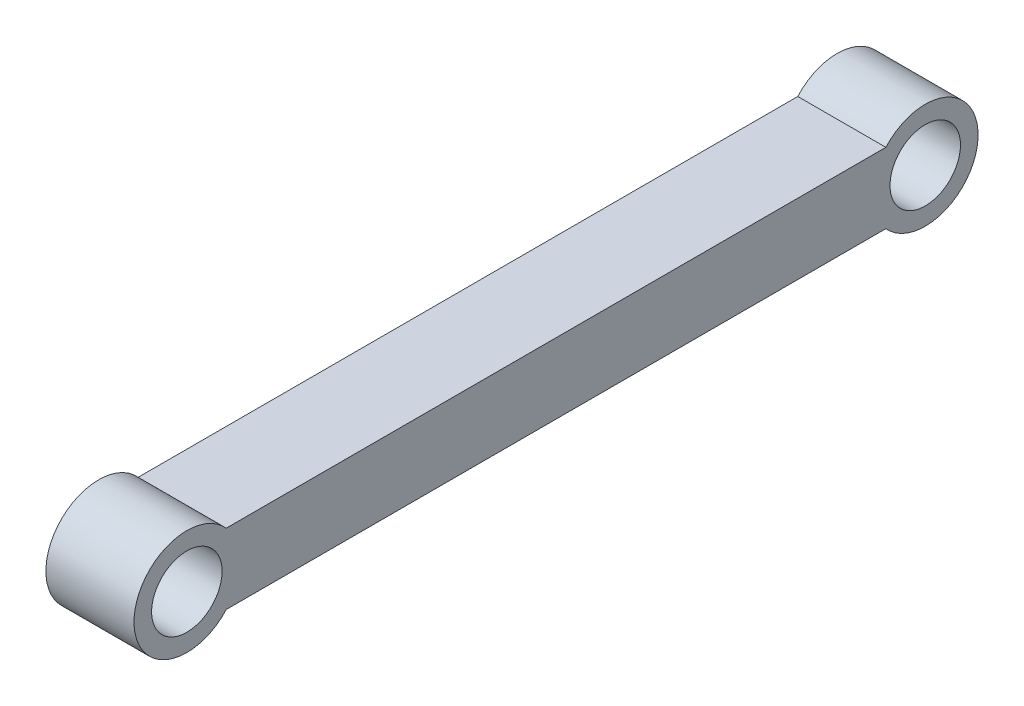
ISO-10303-21;
HEADER;
FILE_DESCRIPTION(('STEP AP214'),'2;1');
FILE_NAME('part.step','',(''),(''),'','','');
FILE_SCHEMA(('AUTOMOTIVE_DESIGN { 1 0 10303 214 1 1 1 1 }'));
ENDSEC;
DATA;
#1=APPLICATION_CONTEXT('core data for automotive mechanical design processes');
#2=APPLICATION_PROTOCOL_DEFINITION('international standard','automotive_design',2000,#1);
#3=PRODUCT_CONTEXT('',#1,'mechanical');
#4=PRODUCT('Part','Part','',(#3));
#5=PRODUCT_RELATED_PRODUCT_CATEGORY('part','',(#4));
#6=PRODUCT_DEFINITION_FORMATION('','',#4);
#7=PRODUCT_DEFINITION_CONTEXT('part definition',#1,'design');
#8=PRODUCT_DEFINITION('design','',#6,#7);
#9=PRODUCT_DEFINITION_SHAPE('','',#8);
#10=(LENGTH_UNIT() NAMED_UNIT(*) SI_UNIT(.MILLI.,.METRE.));
#11=(NAMED_UNIT(*) PLANE_ANGLE_UNIT() SI_UNIT($,.RADIAN.));
#12=(NAMED_UNIT(*) SI_UNIT($,.STERADIAN.) SOLID_ANGLE_UNIT());
#13=UNCERTAINTY_MEASURE_WITH_UNIT(LENGTH_MEASURE(1.E-05),#10,'distance_accuracy_value','');
#14=(GEOMETRIC_REPRESENTATION_CONTEXT(3) GLOBAL_UNCERTAINTY_ASSIGNED_CONTEXT((#13)) GLOBAL_UNIT_ASSIGNED_CONTEXT((#10,
#11,#12)) REPRESENTATION_CONTEXT('',''));
#15=CARTESIAN_POINT('',(0.,0.,0.));
#16=DIRECTION('',(0.,0.,1.));
#17=DIRECTION('',(1.,0.,0.));
#18=AXIS2_PLACEMENT_3D('',#15,#16,#17);
#19=CARTESIAN_POINT('',(100.,-226.263273144616,578.53553858004));
#20=DIRECTION('',(1.,0.,0.));
#21=DIRECTION('',(0.,0.,-1.));
#22=AXIS2_PLACEMENT_3D('',#19,#20,#21);
#23=PLANE('',#22);
#24=CARTESIAN_POINT('',(100.,-226.263273144619,-259.65446141996));
#25=DIRECTION('',(1.,0.,0.));
#26=DIRECTION('',(0.,0.,-1.));
#27=AXIS2_PLACEMENT_3D('',#24,#25,#26);
#28=CIRCLE('',#27,40.0000000000001);
#29=CARTESIAN_POINT('',(100.,-226.263273144619,-299.65446141996));
#30=VERTEX_POINT('',#29);
#31=EDGE_CURVE('E106',#30,#30,#28,.T.);
#32=ORIENTED_EDGE('',*,*,#31,.F.);
#33=EDGE_LOOP('',(#32));
#34=FACE_BOUND('',#33,.T.);
#35=CARTESIAN_POINT('',(100.,-226.263273144616,578.53553858004));
#36=DIRECTION('',(1.,0.,0.));
#37=DIRECTION('',(0.,0.,-1.));
#38=AXIS2_PLACEMENT_3D('',#35,#36,#37);
#39=CIRCLE('',#38,60.);
#40=CARTESIAN_POINT('',(100.,-186.263273144616,533.814179030044));
#41=VERTEX_POINT('',#40);
#42=CARTESIAN_POINT('',(100.,-266.263273144616,533.814179030044));
#43=VERTEX_POINT('',#42);
#44=EDGE_CURVE('E91',#41,#43,#39,.T.);
#45=ORIENTED_EDGE('',*,*,#44,.T.);
#46=DIRECTION('',(0.,0.,-1.));
#47=VECTOR('',#46,1.);
#48=CARTESIAN_POINT('',(100.,-266.263273144616,533.814179030044));
#49=LINE('',#48,#47);
#50=CARTESIAN_POINT('',(100.,-266.263273144618,-214.933101869964));
#51=VERTEX_POINT('',#50);
#52=EDGE_CURVE('E86',#43,#51,#49,.T.);
#53=ORIENTED_EDGE('',*,*,#52,.T.);
#54=CARTESIAN_POINT('',(100.,-226.263273144619,-259.65446141996));
#55=DIRECTION('',(1.,0.,0.));
#56=DIRECTION('',(0.,0.,-1.));
#57=AXIS2_PLACEMENT_3D('',#54,#55,#56);
#58=CIRCLE('',#57,60.);
#59=CARTESIAN_POINT('',(100.,-186.263273144618,-214.933101869965));
#60=VERTEX_POINT('',#59);
#61=EDGE_CURVE('E89',#51,#60,#58,.T.);
#62=ORIENTED_EDGE('',*,*,#61,.T.);
#63=DIRECTION('',(0.,0.,1.));
#64=VECTOR('',#63,1.);
#65=CARTESIAN_POINT('',(100.,-186.263273144616,533.814179030044));
#66=LINE('',#65,#64);
#67=EDGE_CURVE('E56',#60,#41,#66,.T.);
#68=ORIENTED_EDGE('',*,*,#67,.T.);
#69=EDGE_LOOP('',(#45,#53,#62,#68));
#70=FACE_BOUND('',#69,.T.);
#71=CARTESIAN_POINT('',(100.,-226.263273144616,578.53553858004));
#72=DIRECTION('',(1.,0.,0.));
#73=DIRECTION('',(0.,0.,-1.));
#74=AXIS2_PLACEMENT_3D('',#71,#72,#73);
#75=CIRCLE('',#74,39.9999999999999);
#76=CARTESIAN_POINT('',(100.,-226.263273144616,538.53553858004));
#77=VERTEX_POINT('',#76);
#78=EDGE_CURVE('E121',#77,#77,#75,.T.);
#79=ORIENTED_EDGE('',*,*,#78,.F.);
#80=EDGE_LOOP('',(#79));
#81=FACE_BOUND('',#80,.T.);
#82=ADVANCED_FACE('F39',(#34,#70,#81),#23,.T.);
#83=CARTESIAN_POINT('',(0.,-226.263273144616,578.53553858004));
#84=DIRECTION('',(1.,0.,0.));
#85=DIRECTION('',(0.,0.,-1.));
#86=AXIS2_PLACEMENT_3D('',#83,#84,#85);
#87=PLANE('',#86);
#88=CARTESIAN_POINT('',(0.,-226.263273144616,578.53553858004));
#89=DIRECTION('',(1.,0.,0.));
#90=DIRECTION('',(0.,0.,-1.));
#91=AXIS2_PLACEMENT_3D('',#88,#89,#90);
#92=CIRCLE('',#91,60.);
#93=CARTESIAN_POINT('',(0.,-186.263273144616,533.814179030044));
#94=VERTEX_POINT('',#93);
#95=CARTESIAN_POINT('',(0.,-266.263273144616,533.814179030044));
#96=VERTEX_POINT('',#95);
#97=EDGE_CURVE('E103',#94,#96,#92,.T.);
#98=ORIENTED_EDGE('',*,*,#97,.F.);
#99=DIRECTION('',(0.,0.,1.));
#100=VECTOR('',#99,1.);
#101=CARTESIAN_POINT('',(0.,-186.263273144616,533.814179030044));
#102=LINE('',#101,#100);
#103=CARTESIAN_POINT('',(0.,-186.263273144618,-214.933101869965));
#104=VERTEX_POINT('',#103);
#105=EDGE_CURVE('E79',#104,#94,#102,.T.);
#106=ORIENTED_EDGE('',*,*,#105,.F.);
#107=CARTESIAN_POINT('',(0.,-226.263273144619,-259.65446141996));
#108=DIRECTION('',(1.,0.,0.));
#109=DIRECTION('',(0.,0.,-1.));
#110=AXIS2_PLACEMENT_3D('',#107,#108,#109);
#111=CIRCLE('',#110,60.);
#112=CARTESIAN_POINT('',(0.,-266.263273144618,-214.933101869964));
#113=VERTEX_POINT('',#112);
#114=EDGE_CURVE('E73',#113,#104,#111,.T.);
#115=ORIENTED_EDGE('',*,*,#114,.F.);
#116=DIRECTION('',(0.,0.,-1.));
#117=VECTOR('',#116,1.);
#118=CARTESIAN_POINT('',(0.,-266.263273144616,533.814179030044));
#119=LINE('',#118,#117);
#120=EDGE_CURVE('E95',#96,#113,#119,.T.);
#121=ORIENTED_EDGE('',*,*,#120,.F.);
#122=EDGE_LOOP('',(#98,#106,#115,#121));
#123=FACE_BOUND('',#122,.T.);
#124=CARTESIAN_POINT('',(0.,-226.263273144619,-259.65446141996));
#125=DIRECTION('',(1.,0.,0.));
#126=DIRECTION('',(0.,0.,-1.));
#127=AXIS2_PLACEMENT_3D('',#124,#125,#126);
#128=CIRCLE('',#127,40.0000000000001);
#129=CARTESIAN_POINT('',(0.,-226.263273144619,-299.65446141996));
#130=VERTEX_POINT('',#129);
#131=EDGE_CURVE('E118',#130,#130,#128,.T.);
#132=ORIENTED_EDGE('',*,*,#131,.T.);
#133=EDGE_LOOP('',(#132));
#134=FACE_BOUND('',#133,.T.);
#135=CARTESIAN_POINT('',(0.,-226.263273144616,578.53553858004));
#136=DIRECTION('',(1.,0.,0.));
#137=DIRECTION('',(0.,0.,-1.));
#138=AXIS2_PLACEMENT_3D('',#135,#136,#137);
#139=CIRCLE('',#138,39.9999999999999);
#140=CARTESIAN_POINT('',(0.,-226.263273144616,538.53553858004));
#141=VERTEX_POINT('',#140);
#142=EDGE_CURVE('E124',#141,#141,#139,.T.);
#143=ORIENTED_EDGE('',*,*,#142,.T.);
#144=EDGE_LOOP('',(#143));
#145=FACE_BOUND('',#144,.T.);
#146=ADVANCED_FACE('F114',(#123,#134,#145),#87,.F.);
#147=CARTESIAN_POINT('',(100.,-226.263273144616,578.53553858004));
#148=DIRECTION('',(-1.,0.,0.));
#149=DIRECTION('',(0.,0.,1.));
#150=AXIS2_PLACEMENT_3D('',#147,#148,#149);
#151=CYLINDRICAL_SURFACE('',#150,60.);
#152=ORIENTED_EDGE('',*,*,#97,.T.);
#153=DIRECTION('',(-1.,0.,0.));
#154=VECTOR('',#153,1.);
#155=CARTESIAN_POINT('',(100.,-266.263273144616,533.814179030044));
#156=LINE('',#155,#154);
#157=EDGE_CURVE('E11',#43,#96,#156,.T.);
#158=ORIENTED_EDGE('',*,*,#157,.F.);
#159=ORIENTED_EDGE('',*,*,#44,.F.);
#160=DIRECTION('',(-1.,0.,0.));
#161=VECTOR('',#160,1.);
#162=CARTESIAN_POINT('',(100.,-186.263273144616,533.814179030044));
#163=LINE('',#162,#161);
#164=EDGE_CURVE('E99',#41,#94,#163,.T.);
#165=ORIENTED_EDGE('',*,*,#164,.T.);
#166=EDGE_LOOP('',(#152,#158,#159,#165));
#167=FACE_BOUND('',#166,.T.);
#168=ADVANCED_FACE('F41',(#167),#151,.T.);
#169=CARTESIAN_POINT('',(100.,-266.263273144616,533.814179030044));
#170=DIRECTION('',(0.,1.,0.));
#171=DIRECTION('',(0.,0.,1.));
#172=AXIS2_PLACEMENT_3D('',#169,#170,#171);
#173=PLANE('',#172);
#174=ORIENTED_EDGE('',*,*,#120,.T.);
#175=DIRECTION('',(-1.,0.,0.));
#176=VECTOR('',#175,1.);
#177=CARTESIAN_POINT('',(100.,-266.263273144618,-214.933101869964));
#178=LINE('',#177,#176);
#179=EDGE_CURVE('E48',#51,#113,#178,.T.);
#180=ORIENTED_EDGE('',*,*,#179,.F.);
#181=ORIENTED_EDGE('',*,*,#52,.F.);
#182=ORIENTED_EDGE('',*,*,#157,.T.);
#183=EDGE_LOOP('',(#174,#180,#181,#182));
#184=FACE_BOUND('',#183,.T.);
#185=ADVANCED_FACE('F94',(#184),#173,.F.);
#186=CARTESIAN_POINT('',(100.,-226.263273144619,-259.65446141996));
#187=DIRECTION('',(-1.,0.,0.));
#188=DIRECTION('',(0.,0.,1.));
#189=AXIS2_PLACEMENT_3D('',#186,#187,#188);
#190=CYLINDRICAL_SURFACE('',#189,60.);
#191=ORIENTED_EDGE('',*,*,#114,.T.);
#192=DIRECTION('',(-1.,0.,0.));
#193=VECTOR('',#192,1.);
#194=CARTESIAN_POINT('',(100.,-186.263273144618,-214.933101869965));
#195=LINE('',#194,#193);
#196=EDGE_CURVE('E96',#60,#104,#195,.T.);
#197=ORIENTED_EDGE('',*,*,#196,.F.);
#198=ORIENTED_EDGE('',*,*,#61,.F.);
#199=ORIENTED_EDGE('',*,*,#179,.T.);
#200=EDGE_LOOP('',(#191,#197,#198,#199));
#201=FACE_BOUND('',#200,.T.);
#202=ADVANCED_FACE('F97',(#201),#190,.T.);
#203=CARTESIAN_POINT('',(100.,-186.263273144616,533.814179030044));
#204=DIRECTION('',(0.,-1.,0.));
#205=DIRECTION('',(0.,0.,-1.));
#206=AXIS2_PLACEMENT_3D('',#203,#204,#205);
#207=PLANE('',#206);
#208=ORIENTED_EDGE('',*,*,#105,.T.);
#209=ORIENTED_EDGE('',*,*,#164,.F.);
#210=ORIENTED_EDGE('',*,*,#67,.F.);
#211=ORIENTED_EDGE('',*,*,#196,.T.);
#212=EDGE_LOOP('',(#208,#209,#210,#211));
#213=FACE_BOUND('',#212,.T.);
#214=ADVANCED_FACE('F111',(#213),#207,.F.);
#215=CARTESIAN_POINT('',(100.,-226.263273144619,-259.65446141996));
#216=DIRECTION('',(-1.,0.,0.));
#217=DIRECTION('',(0.,0.,1.));
#218=AXIS2_PLACEMENT_3D('',#215,#216,#217);
#219=CYLINDRICAL_SURFACE('',#218,40.0000000000001);
#220=ORIENTED_EDGE('',*,*,#31,.T.);
#221=EDGE_LOOP('',(#220));
#222=FACE_BOUND('',#221,.T.);
#223=ORIENTED_EDGE('',*,*,#131,.F.);
#224=EDGE_LOOP('',(#223));
#225=FACE_BOUND('',#224,.T.);
#226=ADVANCED_FACE('F141',(#222,#225),#219,.F.);
#227=CARTESIAN_POINT('',(100.,-226.263273144616,578.53553858004));
#228=DIRECTION('',(-1.,0.,0.));
#229=DIRECTION('',(0.,0.,1.));
#230=AXIS2_PLACEMENT_3D('',#227,#228,#229);
#231=CYLINDRICAL_SURFACE('',#230,39.9999999999999);
#232=ORIENTED_EDGE('',*,*,#78,.T.);
#233=EDGE_LOOP('',(#232));
#234=FACE_BOUND('',#233,.T.);
#235=ORIENTED_EDGE('',*,*,#142,.F.);
#236=EDGE_LOOP('',(#235));
#237=FACE_BOUND('',#236,.T.);
#238=ADVANCED_FACE('F130',(#234,#237),#231,.F.);
#239=CLOSED_SHELL('',(#82,#146,#168,#185,#202,#214,#226,#238));
#240=MANIFOLD_SOLID_BREP('B2',#239);
#241=ADVANCED_BREP_SHAPE_REPRESENTATION('',(#18,#240),#14);
#242=SHAPE_DEFINITION_REPRESENTATION(#9,#241);
ENDSEC;
END-ISO-10303-21;
